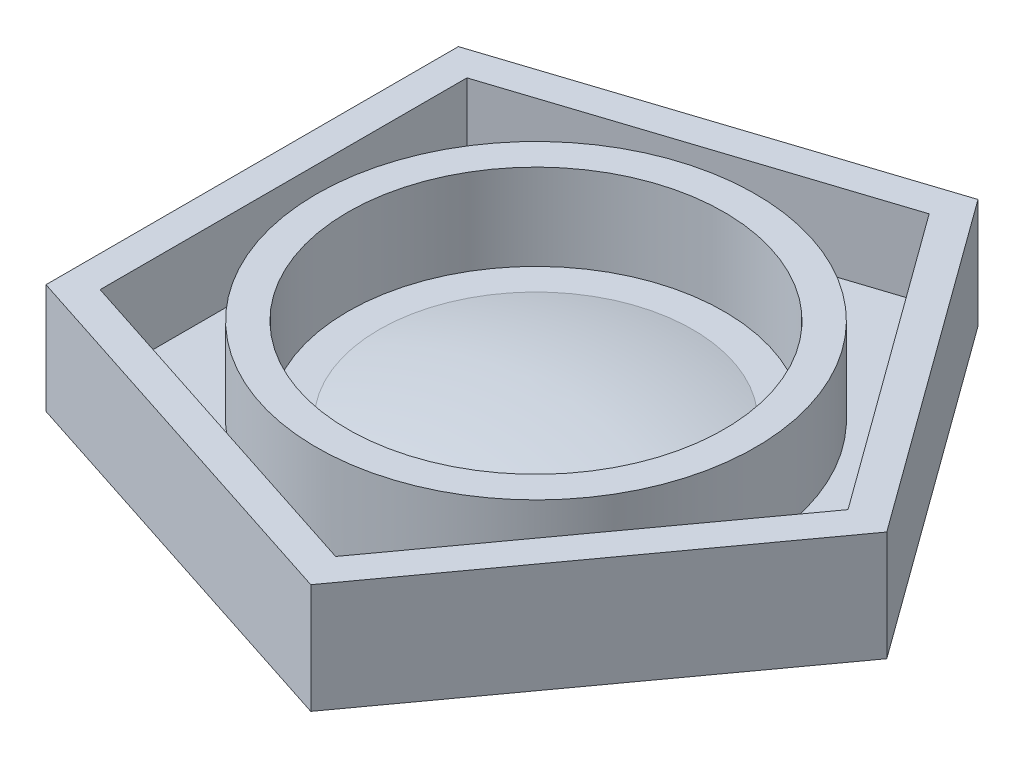
ISO-10303-21;
HEADER;
FILE_DESCRIPTION(('STEP AP214'),'2;1');
FILE_NAME('part.step','',(''),(''),'','','');
FILE_SCHEMA(('AUTOMOTIVE_DESIGN { 1 0 10303 214 1 1 1 1 }'));
ENDSEC;
DATA;
#1=APPLICATION_CONTEXT('core data for automotive mechanical design processes');
#2=APPLICATION_PROTOCOL_DEFINITION('international standard','automotive_design',2000,#1);
#3=PRODUCT_CONTEXT('',#1,'mechanical');
#4=PRODUCT('Part','Part','',(#3));
#5=PRODUCT_RELATED_PRODUCT_CATEGORY('part','',(#4));
#6=PRODUCT_DEFINITION_FORMATION('','',#4);
#7=PRODUCT_DEFINITION_CONTEXT('part definition',#1,'design');
#8=PRODUCT_DEFINITION('design','',#6,#7);
#9=PRODUCT_DEFINITION_SHAPE('','',#8);
#10=(LENGTH_UNIT() NAMED_UNIT(*) SI_UNIT(.MILLI.,.METRE.));
#11=(NAMED_UNIT(*) PLANE_ANGLE_UNIT() SI_UNIT($,.RADIAN.));
#12=(NAMED_UNIT(*) SI_UNIT($,.STERADIAN.) SOLID_ANGLE_UNIT());
#13=UNCERTAINTY_MEASURE_WITH_UNIT(LENGTH_MEASURE(1.E-05),#10,'distance_accuracy_value','');
#14=(GEOMETRIC_REPRESENTATION_CONTEXT(3) GLOBAL_UNCERTAINTY_ASSIGNED_CONTEXT((#13)) GLOBAL_UNIT_ASSIGNED_CONTEXT((#10,
#11,#12)) REPRESENTATION_CONTEXT('',''));
#15=CARTESIAN_POINT('',(0.,0.,0.));
#16=DIRECTION('',(0.,0.,1.));
#17=DIRECTION('',(1.,0.,0.));
#18=AXIS2_PLACEMENT_3D('',#15,#16,#17);
#19=CARTESIAN_POINT('',(0.,-13.8807704216317,0.));
#20=DIRECTION('',(0.,1.,0.));
#21=DIRECTION('',(-1.,0.,0.));
#22=AXIS2_PLACEMENT_3D('',#19,#20,#21);
#23=CYLINDRICAL_SURFACE('',#22,17.78);
#24=CARTESIAN_POINT('',(0.,-8.52871919741788,0.));
#25=DIRECTION('',(0.,1.,0.));
#26=DIRECTION('',(-1.,0.,0.));
#27=AXIS2_PLACEMENT_3D('',#24,#25,#26);
#28=CIRCLE('',#27,17.78);
#29=CARTESIAN_POINT('',(-17.78,-8.52871919741791,0.));
#30=VERTEX_POINT('',#29);
#31=EDGE_CURVE('E38',#30,#30,#28,.T.);
#32=ORIENTED_EDGE('',*,*,#31,.F.);
#33=EDGE_LOOP('',(#32));
#34=FACE_BOUND('',#33,.T.);
#35=CARTESIAN_POINT('',(0.,-15.4938819247976,0.));
#36=DIRECTION('',(0.,-1.,0.));
#37=DIRECTION('',(0.,0.,-1.));
#38=AXIS2_PLACEMENT_3D('',#35,#36,#37);
#39=CIRCLE('',#38,17.78);
#40=CARTESIAN_POINT('',(0.,-15.4938819247976,-17.78));
#41=VERTEX_POINT('',#40);
#42=EDGE_CURVE('E12',#41,#41,#39,.T.);
#43=ORIENTED_EDGE('',*,*,#42,.F.);
#44=EDGE_LOOP('',(#43));
#45=FACE_BOUND('',#44,.T.);
#46=ADVANCED_FACE('F34',(#34,#45),#23,.T.);
#47=CARTESIAN_POINT('',(0.,-64.6807704216317,0.));
#48=DIRECTION('',(0.,1.,0.));
#49=DIRECTION('',(1.,0.,0.));
#50=AXIS2_PLACEMENT_3D('',#47,#48,#49);
#51=SPHERICAL_SURFACE('',#50,50.8);
#52=CARTESIAN_POINT('',(0.,-15.4938819247975,0.));
#53=DIRECTION('',(0.,1.,0.));
#54=DIRECTION('',(-1.,0.,0.));
#55=AXIS2_PLACEMENT_3D('',#52,#53,#54);
#56=CIRCLE('',#55,12.7);
#57=CARTESIAN_POINT('',(-12.7,-15.4938819247975,0.));
#58=VERTEX_POINT('',#57);
#59=EDGE_CURVE('E193',#58,#58,#56,.T.);
#60=ORIENTED_EDGE('',*,*,#59,.T.);
#61=EDGE_LOOP('',(#60));
#62=FACE_BOUND('',#61,.T.);
#63=ADVANCED_FACE('F36',(#62),#51,.T.);
#64=CARTESIAN_POINT('',(17.78,-8.52871919741785,0.));
#65=DIRECTION('',(0.,-1.,0.));
#66=DIRECTION('',(1.,0.,0.));
#67=AXIS2_PLACEMENT_3D('',#64,#65,#66);
#68=PLANE('',#67);
#69=CARTESIAN_POINT('',(0.,-8.52871919741788,0.));
#70=DIRECTION('',(0.,1.,0.));
#71=DIRECTION('',(-1.,0.,0.));
#72=AXIS2_PLACEMENT_3D('',#69,#70,#71);
#73=CIRCLE('',#72,15.24);
#74=CARTESIAN_POINT('',(-15.24,-8.5287191974179,0.));
#75=VERTEX_POINT('',#74);
#76=EDGE_CURVE('E205',#75,#75,#73,.T.);
#77=ORIENTED_EDGE('',*,*,#76,.F.);
#78=EDGE_LOOP('',(#77));
#79=FACE_BOUND('',#78,.T.);
#80=ORIENTED_EDGE('',*,*,#31,.T.);
#81=EDGE_LOOP('',(#80));
#82=FACE_BOUND('',#81,.T.);
#83=ADVANCED_FACE('F212',(#79,#82),#68,.F.);
#84=CARTESIAN_POINT('',(0.,-13.8807704216317,0.));
#85=DIRECTION('',(0.,1.,0.));
#86=DIRECTION('',(-1.,0.,0.));
#87=AXIS2_PLACEMENT_3D('',#84,#85,#86);
#88=CYLINDRICAL_SURFACE('',#87,15.24);
#89=CARTESIAN_POINT('',(0.,-15.4938819247975,0.));
#90=DIRECTION('',(0.,1.,0.));
#91=DIRECTION('',(-1.,0.,0.));
#92=AXIS2_PLACEMENT_3D('',#89,#90,#91);
#93=CIRCLE('',#92,15.24);
#94=CARTESIAN_POINT('',(-15.24,-15.4938819247975,0.));
#95=VERTEX_POINT('',#94);
#96=EDGE_CURVE('E203',#95,#95,#93,.T.);
#97=ORIENTED_EDGE('',*,*,#96,.F.);
#98=EDGE_LOOP('',(#97));
#99=FACE_BOUND('',#98,.T.);
#100=ORIENTED_EDGE('',*,*,#76,.T.);
#101=EDGE_LOOP('',(#100));
#102=FACE_BOUND('',#101,.T.);
#103=ADVANCED_FACE('F230',(#99,#102),#88,.F.);
#104=CARTESIAN_POINT('',(15.24,-15.4938819247975,0.));
#105=DIRECTION('',(0.,-1.,0.));
#106=DIRECTION('',(1.,0.,0.));
#107=AXIS2_PLACEMENT_3D('',#104,#105,#106);
#108=PLANE('',#107);
#109=ORIENTED_EDGE('',*,*,#59,.F.);
#110=EDGE_LOOP('',(#109));
#111=FACE_BOUND('',#110,.T.);
#112=ORIENTED_EDGE('',*,*,#96,.T.);
#113=EDGE_LOOP('',(#112));
#114=FACE_BOUND('',#113,.T.);
#115=ADVANCED_FACE('F221',(#111,#114),#108,.F.);
#116=CARTESIAN_POINT('',(1.02745158285619,-15.4938819247976,0.746487270411435));
#117=DIRECTION('',(0.,-1.,0.));
#118=DIRECTION('',(0.587785252292469,0.,-0.809016994374951));
#119=AXIS2_PLACEMENT_3D('',#116,#117,#118);
#120=PLANE('',#119);
#121=DIRECTION('',(0.951056516295155,0.,0.309016994374942));
#122=VECTOR('',#121,1.);
#123=CARTESIAN_POINT('',(-20.447,-15.4938819247976,14.8556150701257));
#124=LINE('',#123,#122);
#125=CARTESIAN_POINT('',(-20.447,-15.4938819247976,14.8556150701257));
#126=VERTEX_POINT('',#125);
#127=CARTESIAN_POINT('',(7.81005903203104,-15.4938819247976,24.0368901072483));
#128=VERTEX_POINT('',#127);
#129=EDGE_CURVE('E123',#126,#128,#124,.T.);
#130=ORIENTED_EDGE('',*,*,#129,.T.);
#131=DIRECTION('',(0.587785252292469,0.,-0.809016994374951));
#132=VECTOR('',#131,1.);
#133=CARTESIAN_POINT('',(7.81005903203104,-15.4938819247976,24.0368901072483));
#134=LINE('',#133,#132);
#135=CARTESIAN_POINT('',(25.2738819359382,-15.4938819247976,-1.48274588491968E-13));
#136=VERTEX_POINT('',#135);
#137=EDGE_CURVE('E145',#128,#136,#134,.T.);
#138=ORIENTED_EDGE('',*,*,#137,.T.);
#139=DIRECTION('',(-0.587785252292478,0.,-0.809016994374944));
#140=VECTOR('',#139,1.);
#141=CARTESIAN_POINT('',(25.2738819359382,-15.4938819247976,-1.48274588491968E-13));
#142=LINE('',#141,#140);
#143=CARTESIAN_POINT('',(7.81005903203079,-15.4938819247976,-24.0368901072484));
#144=VERTEX_POINT('',#143);
#145=EDGE_CURVE('E129',#136,#144,#142,.T.);
#146=ORIENTED_EDGE('',*,*,#145,.T.);
#147=DIRECTION('',(-0.951056516295152,0.,0.309016994374953));
#148=VECTOR('',#147,1.);
#149=CARTESIAN_POINT('',(7.81005903203079,-15.4938819247976,-24.0368901072484));
#150=LINE('',#149,#148);
#151=CARTESIAN_POINT('',(-20.447,-15.4938819247976,-14.8556150701255));
#152=VERTEX_POINT('',#151);
#153=EDGE_CURVE('E148',#144,#152,#150,.T.);
#154=ORIENTED_EDGE('',*,*,#153,.T.);
#155=DIRECTION('',(0.,0.,1.));
#156=VECTOR('',#155,1.);
#157=CARTESIAN_POINT('',(-20.447,-15.4938819247976,-14.8556150701255));
#158=LINE('',#157,#156);
#159=EDGE_CURVE('E151',#152,#126,#158,.T.);
#160=ORIENTED_EDGE('',*,*,#159,.T.);
#161=EDGE_LOOP('',(#130,#138,#146,#154,#160));
#162=FACE_BOUND('',#161,.T.);
#163=ORIENTED_EDGE('',*,*,#42,.T.);
#164=EDGE_LOOP('',(#163));
#165=FACE_BOUND('',#164,.T.);
#166=ADVANCED_FACE('F219',(#162,#165),#120,.F.);
#167=CARTESIAN_POINT('',(0.,-9.14388192479756,0.));
#168=DIRECTION('',(0.,1.,0.));
#169=DIRECTION('',(0.,0.,1.));
#170=AXIS2_PLACEMENT_3D('',#167,#168,#169);
#171=PLANE('',#170);
#172=DIRECTION('',(0.587785252292469,0.,-0.809016994374951));
#173=VECTOR('',#172,1.);
#174=CARTESIAN_POINT('',(8.78025270060633,-9.14388192479756,27.0228391888941));
#175=LINE('',#174,#173);
#176=CARTESIAN_POINT('',(8.78025270060633,-9.14388192479756,27.0228391888941));
#177=VERTEX_POINT('',#176);
#178=CARTESIAN_POINT('',(28.4134945987877,-9.14388192479756,-1.66406343977824E-13));
#179=VERTEX_POINT('',#178);
#180=EDGE_CURVE('E130',#177,#179,#175,.T.);
#181=ORIENTED_EDGE('',*,*,#180,.T.);
#182=DIRECTION('',(-0.587785252292478,0.,-0.809016994374944));
#183=VECTOR('',#182,1.);
#184=CARTESIAN_POINT('',(28.4134945987877,-9.14388192479756,-1.66406343977824E-13));
#185=LINE('',#184,#183);
#186=CARTESIAN_POINT('',(8.78025270060604,-9.14388192479756,-27.0228391888942));
#187=VERTEX_POINT('',#186);
#188=EDGE_CURVE('E164',#179,#187,#185,.T.);
#189=ORIENTED_EDGE('',*,*,#188,.T.);
#190=DIRECTION('',(-0.951056516295152,0.,0.309016994374953));
#191=VECTOR('',#190,1.);
#192=CARTESIAN_POINT('',(8.78025270060604,-9.14388192479756,-27.0228391888942));
#193=LINE('',#192,#191);
#194=CARTESIAN_POINT('',(-22.987,-9.14388192479756,-16.7010330912591));
#195=VERTEX_POINT('',#194);
#196=EDGE_CURVE('E167',#187,#195,#193,.T.);
#197=ORIENTED_EDGE('',*,*,#196,.T.);
#198=DIRECTION('',(0.,0.,1.));
#199=VECTOR('',#198,1.);
#200=CARTESIAN_POINT('',(-22.987,-9.14388192479756,-16.7010330912591));
#201=LINE('',#200,#199);
#202=CARTESIAN_POINT('',(-22.987,-9.14388192479756,16.7010330912593));
#203=VERTEX_POINT('',#202);
#204=EDGE_CURVE('E170',#195,#203,#201,.T.);
#205=ORIENTED_EDGE('',*,*,#204,.T.);
#206=DIRECTION('',(0.951056516295155,0.,0.309016994374942));
#207=VECTOR('',#206,1.);
#208=CARTESIAN_POINT('',(-22.987,-9.14388192479756,16.7010330912593));
#209=LINE('',#208,#207);
#210=EDGE_CURVE('E173',#203,#177,#209,.T.);
#211=ORIENTED_EDGE('',*,*,#210,.T.);
#212=EDGE_LOOP('',(#181,#189,#197,#205,#211));
#213=FACE_BOUND('',#212,.T.);
#214=DIRECTION('',(-0.587785252292478,0.,-0.809016994374944));
#215=VECTOR('',#214,1.);
#216=CARTESIAN_POINT('',(25.2738819359382,-9.14388192479756,-1.48114992126164E-13));
#217=LINE('',#216,#215);
#218=CARTESIAN_POINT('',(25.2738819359382,-9.14388192479756,-1.48114992126164E-13));
#219=VERTEX_POINT('',#218);
#220=CARTESIAN_POINT('',(7.81005903203079,-9.14388192479756,-24.0368901072484));
#221=VERTEX_POINT('',#220);
#222=EDGE_CURVE('E122',#219,#221,#217,.T.);
#223=ORIENTED_EDGE('',*,*,#222,.F.);
#224=DIRECTION('',(0.587785252292469,0.,-0.809016994374951));
#225=VECTOR('',#224,1.);
#226=CARTESIAN_POINT('',(7.81005903203104,-9.14388192479756,24.0368901072483));
#227=LINE('',#226,#225);
#228=CARTESIAN_POINT('',(7.81005903203104,-9.14388192479756,24.0368901072483));
#229=VERTEX_POINT('',#228);
#230=EDGE_CURVE('E114',#229,#219,#227,.T.);
#231=ORIENTED_EDGE('',*,*,#230,.F.);
#232=DIRECTION('',(0.951056516295155,0.,0.309016994374942));
#233=VECTOR('',#232,1.);
#234=CARTESIAN_POINT('',(-20.447,-9.14388192479756,14.8556150701257));
#235=LINE('',#234,#233);
#236=CARTESIAN_POINT('',(-20.4470000000001,-9.14388192479756,14.8556150701257));
#237=VERTEX_POINT('',#236);
#238=EDGE_CURVE('E143',#237,#229,#235,.T.);
#239=ORIENTED_EDGE('',*,*,#238,.F.);
#240=DIRECTION('',(0.,0.,1.));
#241=VECTOR('',#240,1.);
#242=CARTESIAN_POINT('',(-20.447,-9.14388192479756,-14.8556150701255));
#243=LINE('',#242,#241);
#244=CARTESIAN_POINT('',(-20.447,-9.14388192479756,-14.8556150701255));
#245=VERTEX_POINT('',#244);
#246=EDGE_CURVE('E138',#245,#237,#243,.T.);
#247=ORIENTED_EDGE('',*,*,#246,.F.);
#248=DIRECTION('',(-0.951056516295152,0.,0.309016994374953));
#249=VECTOR('',#248,1.);
#250=CARTESIAN_POINT('',(7.81005903203079,-9.14388192479756,-24.0368901072484));
#251=LINE('',#250,#249);
#252=EDGE_CURVE('E136',#221,#245,#251,.T.);
#253=ORIENTED_EDGE('',*,*,#252,.F.);
#254=EDGE_LOOP('',(#223,#231,#239,#247,#253));
#255=FACE_BOUND('',#254,.T.);
#256=ADVANCED_FACE('F134',(#213,#255),#171,.T.);
#257=CARTESIAN_POINT('',(7.81005903203104,-9.14388192479756,24.0368901072483));
#258=DIRECTION('',(-0.809016994374951,0.,-0.587785252292468));
#259=DIRECTION('',(-0.587785252292469,0.,0.809016994374951));
#260=AXIS2_PLACEMENT_3D('',#257,#258,#259);
#261=PLANE('',#260);
#262=ORIENTED_EDGE('',*,*,#137,.F.);
#263=DIRECTION('',(0.,-1.,0.));
#264=VECTOR('',#263,1.);
#265=CARTESIAN_POINT('',(7.81005903203104,-9.14388192479756,24.0368901072483));
#266=LINE('',#265,#264);
#267=EDGE_CURVE('E50',#229,#128,#266,.T.);
#268=ORIENTED_EDGE('',*,*,#267,.F.);
#269=ORIENTED_EDGE('',*,*,#230,.T.);
#270=DIRECTION('',(0.,-1.,0.));
#271=VECTOR('',#270,1.);
#272=CARTESIAN_POINT('',(25.2738819359382,-9.14388192479756,-1.48114992126164E-13));
#273=LINE('',#272,#271);
#274=EDGE_CURVE('E117',#219,#136,#273,.T.);
#275=ORIENTED_EDGE('',*,*,#274,.T.);
#276=EDGE_LOOP('',(#262,#268,#269,#275));
#277=FACE_BOUND('',#276,.T.);
#278=ADVANCED_FACE('F116',(#277),#261,.T.);
#279=CARTESIAN_POINT('',(25.2738819359382,-9.14388192479756,-1.48114992126164E-13));
#280=DIRECTION('',(-0.809016994374944,0.,0.587785252292478));
#281=DIRECTION('',(0.587785252292478,0.,0.809016994374944));
#282=AXIS2_PLACEMENT_3D('',#279,#280,#281);
#283=PLANE('',#282);
#284=ORIENTED_EDGE('',*,*,#145,.F.);
#285=ORIENTED_EDGE('',*,*,#274,.F.);
#286=ORIENTED_EDGE('',*,*,#222,.T.);
#287=DIRECTION('',(0.,-1.,0.));
#288=VECTOR('',#287,1.);
#289=CARTESIAN_POINT('',(7.81005903203079,-9.14388192479756,-24.0368901072484));
#290=LINE('',#289,#288);
#291=EDGE_CURVE('E131',#221,#144,#290,.T.);
#292=ORIENTED_EDGE('',*,*,#291,.T.);
#293=EDGE_LOOP('',(#284,#285,#286,#292));
#294=FACE_BOUND('',#293,.T.);
#295=ADVANCED_FACE('F126',(#294),#283,.T.);
#296=CARTESIAN_POINT('',(7.81005903203079,-9.14388192479756,-24.0368901072484));
#297=DIRECTION('',(0.309016994374953,0.,0.951056516295152));
#298=DIRECTION('',(0.951056516295152,0.,-0.309016994374953));
#299=AXIS2_PLACEMENT_3D('',#296,#297,#298);
#300=PLANE('',#299);
#301=ORIENTED_EDGE('',*,*,#153,.F.);
#302=ORIENTED_EDGE('',*,*,#291,.F.);
#303=ORIENTED_EDGE('',*,*,#252,.T.);
#304=DIRECTION('',(0.,-1.,0.));
#305=VECTOR('',#304,1.);
#306=CARTESIAN_POINT('',(-20.447,-9.14388192479756,-14.8556150701255));
#307=LINE('',#306,#305);
#308=EDGE_CURVE('E159',#245,#152,#307,.T.);
#309=ORIENTED_EDGE('',*,*,#308,.T.);
#310=EDGE_LOOP('',(#301,#302,#303,#309));
#311=FACE_BOUND('',#310,.T.);
#312=ADVANCED_FACE('F278',(#311),#300,.T.);
#313=CARTESIAN_POINT('',(-20.447,-9.14388192479756,-14.8556150701255));
#314=DIRECTION('',(1.,0.,0.));
#315=DIRECTION('',(0.,1.,0.));
#316=AXIS2_PLACEMENT_3D('',#313,#314,#315);
#317=PLANE('',#316);
#318=ORIENTED_EDGE('',*,*,#159,.F.);
#319=ORIENTED_EDGE('',*,*,#308,.F.);
#320=ORIENTED_EDGE('',*,*,#246,.T.);
#321=DIRECTION('',(0.,-1.,0.));
#322=VECTOR('',#321,1.);
#323=CARTESIAN_POINT('',(-20.447,-9.14388192479756,14.8556150701257));
#324=LINE('',#323,#322);
#325=EDGE_CURVE('E157',#237,#126,#324,.T.);
#326=ORIENTED_EDGE('',*,*,#325,.T.);
#327=EDGE_LOOP('',(#318,#319,#320,#326));
#328=FACE_BOUND('',#327,.T.);
#329=ADVANCED_FACE('F266',(#328),#317,.T.);
#330=CARTESIAN_POINT('',(-20.447,-9.14388192479756,14.8556150701257));
#331=DIRECTION('',(0.309016994374942,0.,-0.951056516295155));
#332=DIRECTION('',(-0.951056516295155,0.,-0.309016994374942));
#333=AXIS2_PLACEMENT_3D('',#330,#331,#332);
#334=PLANE('',#333);
#335=ORIENTED_EDGE('',*,*,#129,.F.);
#336=ORIENTED_EDGE('',*,*,#325,.F.);
#337=ORIENTED_EDGE('',*,*,#238,.T.);
#338=ORIENTED_EDGE('',*,*,#267,.T.);
#339=EDGE_LOOP('',(#335,#336,#337,#338));
#340=FACE_BOUND('',#339,.T.);
#341=ADVANCED_FACE('F261',(#340),#334,.T.);
#342=CARTESIAN_POINT('',(0.,-18.0338819247975,0.));
#343=DIRECTION('',(0.,1.,0.));
#344=DIRECTION('',(-1.,0.,0.));
#345=AXIS2_PLACEMENT_3D('',#342,#343,#344);
#346=PLANE('',#345);
#347=DIRECTION('',(0.587785252292478,0.,0.809016994374944));
#348=VECTOR('',#347,1.);
#349=CARTESIAN_POINT('',(8.78025270060604,-18.0338819247975,-27.0228391888942));
#350=LINE('',#349,#348);
#351=CARTESIAN_POINT('',(8.78025270060604,-18.0338819247975,-27.0228391888942));
#352=VERTEX_POINT('',#351);
#353=CARTESIAN_POINT('',(28.4134945987877,-18.0338819247975,-1.66565939208393E-13));
#354=VERTEX_POINT('',#353);
#355=EDGE_CURVE('E176',#352,#354,#350,.T.);
#356=ORIENTED_EDGE('',*,*,#355,.T.);
#357=DIRECTION('',(-0.587785252292469,0.,0.809016994374951));
#358=VECTOR('',#357,1.);
#359=CARTESIAN_POINT('',(28.4134945987877,-18.0338819247975,-1.66565939208393E-13));
#360=LINE('',#359,#358);
#361=CARTESIAN_POINT('',(8.78025270060633,-18.0338819247975,27.0228391888941));
#362=VERTEX_POINT('',#361);
#363=EDGE_CURVE('E179',#354,#362,#360,.T.);
#364=ORIENTED_EDGE('',*,*,#363,.T.);
#365=DIRECTION('',(-0.951056516295155,0.,-0.309016994374942));
#366=VECTOR('',#365,1.);
#367=CARTESIAN_POINT('',(8.78025270060633,-18.0338819247975,27.0228391888941));
#368=LINE('',#367,#366);
#369=CARTESIAN_POINT('',(-22.9869999999999,-18.0338819247976,16.7010330912593));
#370=VERTEX_POINT('',#369);
#371=EDGE_CURVE('E182',#362,#370,#368,.T.);
#372=ORIENTED_EDGE('',*,*,#371,.T.);
#373=DIRECTION('',(0.,0.,-1.));
#374=VECTOR('',#373,1.);
#375=CARTESIAN_POINT('',(-22.9869999999999,-18.0338819247976,16.7010330912593));
#376=LINE('',#375,#374);
#377=CARTESIAN_POINT('',(-22.987,-18.0338819247976,-16.7010330912591));
#378=VERTEX_POINT('',#377);
#379=EDGE_CURVE('E185',#370,#378,#376,.T.);
#380=ORIENTED_EDGE('',*,*,#379,.T.);
#381=DIRECTION('',(0.951056516295152,0.,-0.309016994374953));
#382=VECTOR('',#381,1.);
#383=CARTESIAN_POINT('',(-22.987,-18.0338819247976,-16.7010330912591));
#384=LINE('',#383,#382);
#385=EDGE_CURVE('E188',#378,#352,#384,.T.);
#386=ORIENTED_EDGE('',*,*,#385,.T.);
#387=EDGE_LOOP('',(#356,#364,#372,#380,#386));
#388=FACE_BOUND('',#387,.T.);
#389=ADVANCED_FACE('F250',(#388),#346,.F.);
#390=CARTESIAN_POINT('',(28.4134945987876,59.0912787729937,-1.66565939208393E-13));
#391=DIRECTION('',(0.809016994374951,0.,0.587785252292469));
#392=DIRECTION('',(0.587785252292469,0.,-0.809016994374951));
#393=AXIS2_PLACEMENT_3D('',#390,#391,#392);
#394=PLANE('',#393);
#395=DIRECTION('',(0.,-1.,0.));
#396=VECTOR('',#395,1.);
#397=CARTESIAN_POINT('',(28.4134945987876,59.0912787729937,-1.66565939208393E-13));
#398=LINE('',#397,#396);
#399=EDGE_CURVE('E191',#179,#354,#398,.T.);
#400=ORIENTED_EDGE('',*,*,#399,.F.);
#401=ORIENTED_EDGE('',*,*,#180,.F.);
#402=DIRECTION('',(0.,-1.,0.));
#403=VECTOR('',#402,1.);
#404=CARTESIAN_POINT('',(8.78025270060621,59.0912787729937,27.0228391888941));
#405=LINE('',#404,#403);
#406=EDGE_CURVE('E198',#177,#362,#405,.T.);
#407=ORIENTED_EDGE('',*,*,#406,.T.);
#408=ORIENTED_EDGE('',*,*,#363,.F.);
#409=EDGE_LOOP('',(#400,#401,#407,#408));
#410=FACE_BOUND('',#409,.T.);
#411=ADVANCED_FACE('F246',(#410),#394,.T.);
#412=CARTESIAN_POINT('',(8.78025270060621,59.0912787729937,27.0228391888941));
#413=DIRECTION('',(-0.309016994374942,0.,0.951056516295155));
#414=DIRECTION('',(0.951056516295155,0.,0.309016994374942));
#415=AXIS2_PLACEMENT_3D('',#412,#413,#414);
#416=PLANE('',#415);
#417=ORIENTED_EDGE('',*,*,#406,.F.);
#418=ORIENTED_EDGE('',*,*,#210,.F.);
#419=DIRECTION('',(0.,-1.,0.));
#420=VECTOR('',#419,1.);
#421=CARTESIAN_POINT('',(-22.987,59.0912787729936,16.7010330912593));
#422=LINE('',#421,#420);
#423=EDGE_CURVE('E196',#203,#370,#422,.T.);
#424=ORIENTED_EDGE('',*,*,#423,.T.);
#425=ORIENTED_EDGE('',*,*,#371,.F.);
#426=EDGE_LOOP('',(#417,#418,#424,#425));
#427=FACE_BOUND('',#426,.T.);
#428=ADVANCED_FACE('F242',(#427),#416,.T.);
#429=CARTESIAN_POINT('',(-22.987,59.0912787729936,16.7010330912593));
#430=DIRECTION('',(-1.,0.,0.));
#431=DIRECTION('',(0.,0.,1.));
#432=AXIS2_PLACEMENT_3D('',#429,#430,#431);
#433=PLANE('',#432);
#434=ORIENTED_EDGE('',*,*,#423,.F.);
#435=ORIENTED_EDGE('',*,*,#204,.F.);
#436=DIRECTION('',(0.,-1.,0.));
#437=VECTOR('',#436,1.);
#438=CARTESIAN_POINT('',(-22.9870000000002,59.0912787729936,-16.7010330912591));
#439=LINE('',#438,#437);
#440=EDGE_CURVE('E194',#195,#378,#439,.T.);
#441=ORIENTED_EDGE('',*,*,#440,.T.);
#442=ORIENTED_EDGE('',*,*,#379,.F.);
#443=EDGE_LOOP('',(#434,#435,#441,#442));
#444=FACE_BOUND('',#443,.T.);
#445=ADVANCED_FACE('F239',(#444),#433,.T.);
#446=CARTESIAN_POINT('',(-22.9870000000002,59.0912787729936,-16.7010330912591));
#447=DIRECTION('',(-0.309016994374953,0.,-0.951056516295152));
#448=DIRECTION('',(-0.951056516295152,0.,0.309016994374953));
#449=AXIS2_PLACEMENT_3D('',#446,#447,#448);
#450=PLANE('',#449);
#451=ORIENTED_EDGE('',*,*,#440,.F.);
#452=ORIENTED_EDGE('',*,*,#196,.F.);
#453=DIRECTION('',(0.,-1.,0.));
#454=VECTOR('',#453,1.);
#455=CARTESIAN_POINT('',(8.78025270060592,59.0912787729937,-27.0228391888942));
#456=LINE('',#455,#454);
#457=EDGE_CURVE('E58',#187,#352,#456,.T.);
#458=ORIENTED_EDGE('',*,*,#457,.T.);
#459=ORIENTED_EDGE('',*,*,#385,.F.);
#460=EDGE_LOOP('',(#451,#452,#458,#459));
#461=FACE_BOUND('',#460,.T.);
#462=ADVANCED_FACE('F235',(#461),#450,.T.);
#463=CARTESIAN_POINT('',(8.78025270060592,59.0912787729937,-27.0228391888942));
#464=DIRECTION('',(0.809016994374944,0.,-0.587785252292478));
#465=DIRECTION('',(-0.587785252292478,0.,-0.809016994374944));
#466=AXIS2_PLACEMENT_3D('',#463,#464,#465);
#467=PLANE('',#466);
#468=ORIENTED_EDGE('',*,*,#457,.F.);
#469=ORIENTED_EDGE('',*,*,#188,.F.);
#470=ORIENTED_EDGE('',*,*,#399,.T.);
#471=ORIENTED_EDGE('',*,*,#355,.F.);
#472=EDGE_LOOP('',(#468,#469,#470,#471));
#473=FACE_BOUND('',#472,.T.);
#474=ADVANCED_FACE('F238',(#473),#467,.T.);
#475=CLOSED_SHELL('',(#46,#63,#83,#103,#115,#166,#256,#278,#295,#312,#329,#341,#389,#411,#428,
#445,#462,#474));
#476=MANIFOLD_SOLID_BREP('B2',#475);
#477=ADVANCED_BREP_SHAPE_REPRESENTATION('',(#18,#476),#14);
#478=SHAPE_DEFINITION_REPRESENTATION(#9,#477);
ENDSEC;
END-ISO-10303-21;
